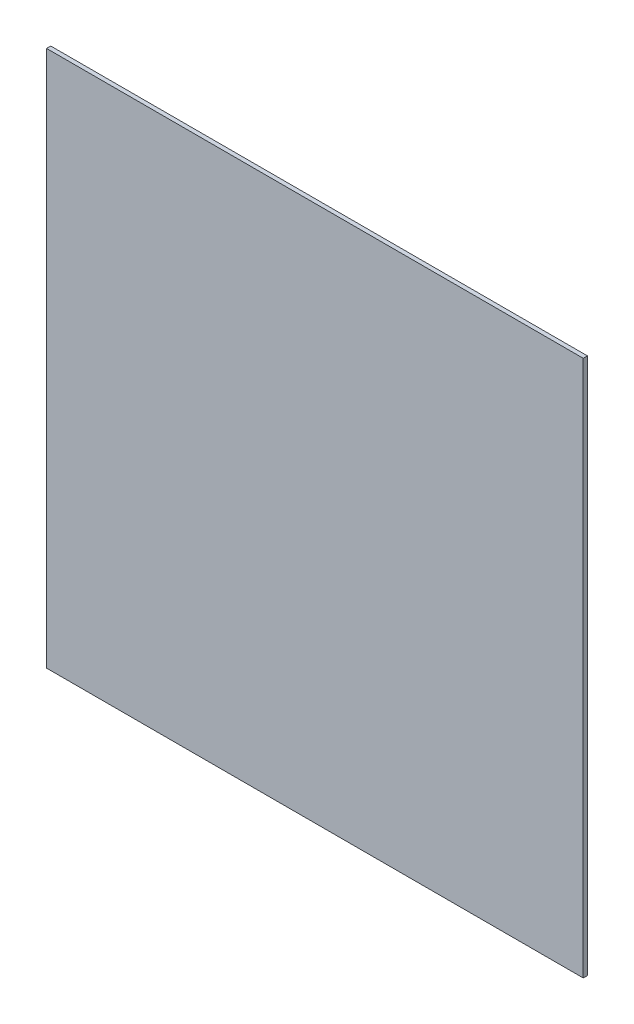
ISO-10303-21;
HEADER;
FILE_DESCRIPTION(('STEP AP214'),'2;1');
FILE_NAME('part.step','',(''),(''),'','','');
FILE_SCHEMA(('AUTOMOTIVE_DESIGN { 1 0 10303 214 1 1 1 1 }'));
ENDSEC;
DATA;
#1=APPLICATION_CONTEXT('core data for automotive mechanical design processes');
#2=APPLICATION_PROTOCOL_DEFINITION('international standard','automotive_design',2000,#1);
#3=PRODUCT_CONTEXT('',#1,'mechanical');
#4=PRODUCT('Part','Part','',(#3));
#5=PRODUCT_RELATED_PRODUCT_CATEGORY('part','',(#4));
#6=PRODUCT_DEFINITION_FORMATION('','',#4);
#7=PRODUCT_DEFINITION_CONTEXT('part definition',#1,'design');
#8=PRODUCT_DEFINITION('design','',#6,#7);
#9=PRODUCT_DEFINITION_SHAPE('','',#8);
#10=(LENGTH_UNIT() NAMED_UNIT(*) SI_UNIT(.MILLI.,.METRE.));
#11=(NAMED_UNIT(*) PLANE_ANGLE_UNIT() SI_UNIT($,.RADIAN.));
#12=(NAMED_UNIT(*) SI_UNIT($,.STERADIAN.) SOLID_ANGLE_UNIT());
#13=UNCERTAINTY_MEASURE_WITH_UNIT(LENGTH_MEASURE(1.E-05),#10,'distance_accuracy_value','');
#14=(GEOMETRIC_REPRESENTATION_CONTEXT(3) GLOBAL_UNCERTAINTY_ASSIGNED_CONTEXT((#13)) GLOBAL_UNIT_ASSIGNED_CONTEXT((#10,
#11,#12)) REPRESENTATION_CONTEXT('',''));
#15=CARTESIAN_POINT('',(0.,0.,0.));
#16=DIRECTION('',(0.,0.,1.));
#17=DIRECTION('',(1.,0.,0.));
#18=AXIS2_PLACEMENT_3D('',#15,#16,#17);
#19=CARTESIAN_POINT('',(0.,0.,0.79375));
#20=DIRECTION('',(1.,0.,0.));
#21=DIRECTION('',(0.,0.,-1.));
#22=AXIS2_PLACEMENT_3D('',#19,#20,#21);
#23=PLANE('',#22);
#24=DIRECTION('',(0.,-1.,0.));
#25=VECTOR('',#24,1.);
#26=CARTESIAN_POINT('',(0.,0.,0.));
#27=LINE('',#26,#25);
#28=CARTESIAN_POINT('',(0.,0.,0.));
#29=VERTEX_POINT('',#28);
#30=CARTESIAN_POINT('',(0.,-101.6,0.));
#31=VERTEX_POINT('',#30);
#32=EDGE_CURVE('E96',#29,#31,#27,.T.);
#33=ORIENTED_EDGE('',*,*,#32,.T.);
#34=DIRECTION('',(0.,0.,-1.));
#35=VECTOR('',#34,1.);
#36=CARTESIAN_POINT('',(0.,-101.6,0.79375));
#37=LINE('',#36,#35);
#38=CARTESIAN_POINT('',(0.,-101.6,0.79375));
#39=VERTEX_POINT('',#38);
#40=EDGE_CURVE('E11',#39,#31,#37,.T.);
#41=ORIENTED_EDGE('',*,*,#40,.F.);
#42=DIRECTION('',(0.,-1.,0.));
#43=VECTOR('',#42,1.);
#44=CARTESIAN_POINT('',(0.,0.,0.79375));
#45=LINE('',#44,#43);
#46=CARTESIAN_POINT('',(0.,0.,0.79375));
#47=VERTEX_POINT('',#46);
#48=EDGE_CURVE('E84',#47,#39,#45,.T.);
#49=ORIENTED_EDGE('',*,*,#48,.F.);
#50=DIRECTION('',(0.,0.,-1.));
#51=VECTOR('',#50,1.);
#52=CARTESIAN_POINT('',(0.,0.,0.79375));
#53=LINE('',#52,#51);
#54=EDGE_CURVE('E92',#47,#29,#53,.T.);
#55=ORIENTED_EDGE('',*,*,#54,.T.);
#56=EDGE_LOOP('',(#33,#41,#49,#55));
#57=FACE_BOUND('',#56,.T.);
#58=ADVANCED_FACE('F33',(#57),#23,.F.);
#59=CARTESIAN_POINT('',(0.,-101.6,0.79375));
#60=DIRECTION('',(0.,1.,0.));
#61=DIRECTION('',(0.,0.,1.));
#62=AXIS2_PLACEMENT_3D('',#59,#60,#61);
#63=PLANE('',#62);
#64=DIRECTION('',(1.,0.,0.));
#65=VECTOR('',#64,1.);
#66=CARTESIAN_POINT('',(0.,-101.6,0.));
#67=LINE('',#66,#65);
#68=CARTESIAN_POINT('',(101.6,-101.6,0.));
#69=VERTEX_POINT('',#68);
#70=EDGE_CURVE('E88',#31,#69,#67,.T.);
#71=ORIENTED_EDGE('',*,*,#70,.T.);
#72=DIRECTION('',(0.,0.,-1.));
#73=VECTOR('',#72,1.);
#74=CARTESIAN_POINT('',(101.6,-101.6,0.79375));
#75=LINE('',#74,#73);
#76=CARTESIAN_POINT('',(101.6,-101.6,0.79375));
#77=VERTEX_POINT('',#76);
#78=EDGE_CURVE('E41',#77,#69,#75,.T.);
#79=ORIENTED_EDGE('',*,*,#78,.F.);
#80=DIRECTION('',(1.,0.,0.));
#81=VECTOR('',#80,1.);
#82=CARTESIAN_POINT('',(0.,-101.6,0.79375));
#83=LINE('',#82,#81);
#84=EDGE_CURVE('E79',#39,#77,#83,.T.);
#85=ORIENTED_EDGE('',*,*,#84,.F.);
#86=ORIENTED_EDGE('',*,*,#40,.T.);
#87=EDGE_LOOP('',(#71,#79,#85,#86));
#88=FACE_BOUND('',#87,.T.);
#89=ADVANCED_FACE('F87',(#88),#63,.F.);
#90=CARTESIAN_POINT('',(101.6,0.,0.79375));
#91=DIRECTION('',(-1.,0.,0.));
#92=DIRECTION('',(0.,-1.,0.));
#93=AXIS2_PLACEMENT_3D('',#90,#91,#92);
#94=PLANE('',#93);
#95=DIRECTION('',(0.,1.,0.));
#96=VECTOR('',#95,1.);
#97=CARTESIAN_POINT('',(101.6,0.,0.));
#98=LINE('',#97,#96);
#99=CARTESIAN_POINT('',(101.6,0.,0.));
#100=VERTEX_POINT('',#99);
#101=EDGE_CURVE('E66',#69,#100,#98,.T.);
#102=ORIENTED_EDGE('',*,*,#101,.T.);
#103=DIRECTION('',(0.,0.,-1.));
#104=VECTOR('',#103,1.);
#105=CARTESIAN_POINT('',(101.6,0.,0.79375));
#106=LINE('',#105,#104);
#107=CARTESIAN_POINT('',(101.6,0.,0.79375));
#108=VERTEX_POINT('',#107);
#109=EDGE_CURVE('E89',#108,#100,#106,.T.);
#110=ORIENTED_EDGE('',*,*,#109,.F.);
#111=DIRECTION('',(0.,1.,0.));
#112=VECTOR('',#111,1.);
#113=CARTESIAN_POINT('',(101.6,0.,0.79375));
#114=LINE('',#113,#112);
#115=EDGE_CURVE('E82',#77,#108,#114,.T.);
#116=ORIENTED_EDGE('',*,*,#115,.F.);
#117=ORIENTED_EDGE('',*,*,#78,.T.);
#118=EDGE_LOOP('',(#102,#110,#116,#117));
#119=FACE_BOUND('',#118,.T.);
#120=ADVANCED_FACE('F90',(#119),#94,.F.);
#121=CARTESIAN_POINT('',(0.,0.,0.79375));
#122=DIRECTION('',(0.,-1.,0.));
#123=DIRECTION('',(0.,0.,-1.));
#124=AXIS2_PLACEMENT_3D('',#121,#122,#123);
#125=PLANE('',#124);
#126=DIRECTION('',(-1.,0.,0.));
#127=VECTOR('',#126,1.);
#128=CARTESIAN_POINT('',(0.,0.,0.));
#129=LINE('',#128,#127);
#130=EDGE_CURVE('E72',#100,#29,#129,.T.);
#131=ORIENTED_EDGE('',*,*,#130,.T.);
#132=ORIENTED_EDGE('',*,*,#54,.F.);
#133=DIRECTION('',(-1.,0.,0.));
#134=VECTOR('',#133,1.);
#135=CARTESIAN_POINT('',(0.,0.,0.79375));
#136=LINE('',#135,#134);
#137=EDGE_CURVE('E49',#108,#47,#136,.T.);
#138=ORIENTED_EDGE('',*,*,#137,.F.);
#139=ORIENTED_EDGE('',*,*,#109,.T.);
#140=EDGE_LOOP('',(#131,#132,#138,#139));
#141=FACE_BOUND('',#140,.T.);
#142=ADVANCED_FACE('F103',(#141),#125,.F.);
#143=CARTESIAN_POINT('',(0.,0.,0.79375));
#144=DIRECTION('',(0.,0.,1.));
#145=DIRECTION('',(1.,0.,0.));
#146=AXIS2_PLACEMENT_3D('',#143,#144,#145);
#147=PLANE('',#146);
#148=ORIENTED_EDGE('',*,*,#48,.T.);
#149=ORIENTED_EDGE('',*,*,#84,.T.);
#150=ORIENTED_EDGE('',*,*,#115,.T.);
#151=ORIENTED_EDGE('',*,*,#137,.T.);
#152=EDGE_LOOP('',(#148,#149,#150,#151));
#153=FACE_BOUND('',#152,.T.);
#154=ADVANCED_FACE('F80',(#153),#147,.T.);
#155=CARTESIAN_POINT('',(0.,0.,0.));
#156=DIRECTION('',(0.,0.,1.));
#157=DIRECTION('',(1.,0.,0.));
#158=AXIS2_PLACEMENT_3D('',#155,#156,#157);
#159=PLANE('',#158);
#160=ORIENTED_EDGE('',*,*,#32,.F.);
#161=ORIENTED_EDGE('',*,*,#130,.F.);
#162=ORIENTED_EDGE('',*,*,#101,.F.);
#163=ORIENTED_EDGE('',*,*,#70,.F.);
#164=EDGE_LOOP('',(#160,#161,#162,#163));
#165=FACE_BOUND('',#164,.T.);
#166=ADVANCED_FACE('F106',(#165),#159,.F.);
#167=CLOSED_SHELL('',(#58,#89,#120,#142,#154,#166));
#168=MANIFOLD_SOLID_BREP('B2',#167);
#169=ADVANCED_BREP_SHAPE_REPRESENTATION('',(#18,#168),#14);
#170=SHAPE_DEFINITION_REPRESENTATION(#9,#169);
ENDSEC;
END-ISO-10303-21;
